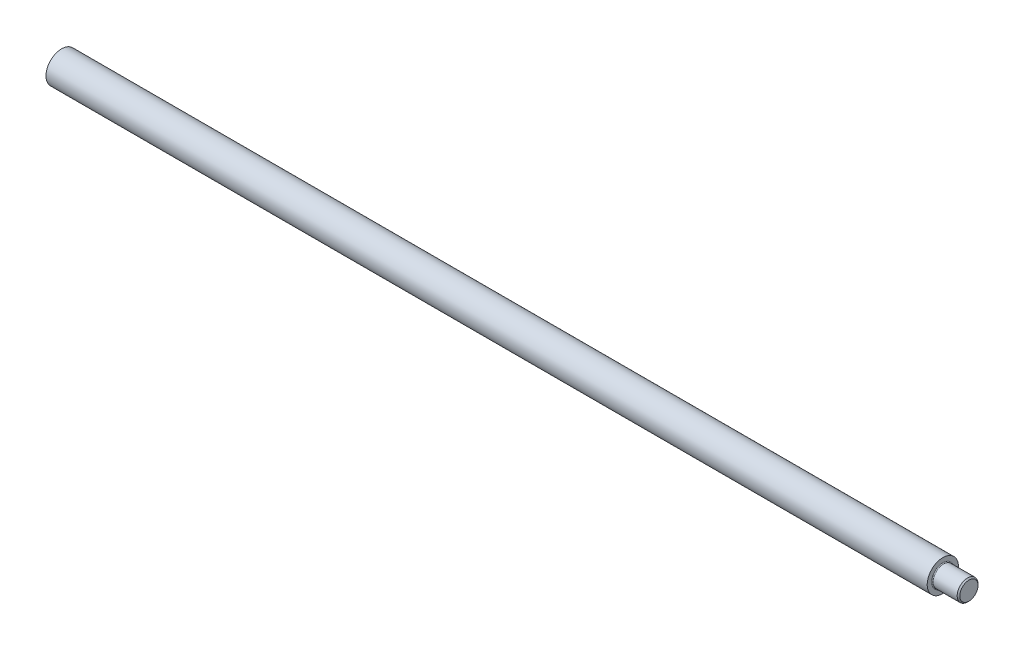
ISO-10303-21;
HEADER;
FILE_DESCRIPTION(('STEP AP214'),'2;1');
FILE_NAME('part.step','',(''),(''),'','','');
FILE_SCHEMA(('AUTOMOTIVE_DESIGN { 1 0 10303 214 1 1 1 1 }'));
ENDSEC;
DATA;
#1=APPLICATION_CONTEXT('core data for automotive mechanical design processes');
#2=APPLICATION_PROTOCOL_DEFINITION('international standard','automotive_design',2000,#1);
#3=PRODUCT_CONTEXT('',#1,'mechanical');
#4=PRODUCT('Part','Part','',(#3));
#5=PRODUCT_RELATED_PRODUCT_CATEGORY('part','',(#4));
#6=PRODUCT_DEFINITION_FORMATION('','',#4);
#7=PRODUCT_DEFINITION_CONTEXT('part definition',#1,'design');
#8=PRODUCT_DEFINITION('design','',#6,#7);
#9=PRODUCT_DEFINITION_SHAPE('','',#8);
#10=(LENGTH_UNIT() NAMED_UNIT(*) SI_UNIT(.MILLI.,.METRE.));
#11=(NAMED_UNIT(*) PLANE_ANGLE_UNIT() SI_UNIT($,.RADIAN.));
#12=(NAMED_UNIT(*) SI_UNIT($,.STERADIAN.) SOLID_ANGLE_UNIT());
#13=UNCERTAINTY_MEASURE_WITH_UNIT(LENGTH_MEASURE(1.E-05),#10,'distance_accuracy_value','');
#14=(GEOMETRIC_REPRESENTATION_CONTEXT(3) GLOBAL_UNCERTAINTY_ASSIGNED_CONTEXT((#13)) GLOBAL_UNIT_ASSIGNED_CONTEXT((#10,
#11,#12)) REPRESENTATION_CONTEXT('',''));
#15=CARTESIAN_POINT('',(0.,0.,0.));
#16=DIRECTION('',(0.,0.,1.));
#17=DIRECTION('',(1.,0.,0.));
#18=AXIS2_PLACEMENT_3D('',#15,#16,#17);
#19=CARTESIAN_POINT('',(30.,0.,0.));
#20=DIRECTION('',(1.,0.,0.));
#21=DIRECTION('',(0.,0.,-1.));
#22=AXIS2_PLACEMENT_3D('',#19,#20,#21);
#23=CYLINDRICAL_SURFACE('',#22,5.68421052631579);
#24=CARTESIAN_POINT('',(30.,0.,0.));
#25=DIRECTION('',(1.,0.,0.));
#26=DIRECTION('',(0.,0.,-1.));
#27=AXIS2_PLACEMENT_3D('',#24,#25,#26);
#28=CIRCLE('',#27,5.68421052631579);
#29=CARTESIAN_POINT('',(30.,0.,-5.68421052631579));
#30=VERTEX_POINT('',#29);
#31=EDGE_CURVE('E55',#30,#30,#28,.T.);
#32=ORIENTED_EDGE('',*,*,#31,.T.);
#33=EDGE_LOOP('',(#32));
#34=FACE_BOUND('',#33,.T.);
#35=CARTESIAN_POINT('',(350.526315789474,0.,0.));
#36=DIRECTION('',(1.,0.,0.));
#37=DIRECTION('',(0.,0.,-1.));
#38=AXIS2_PLACEMENT_3D('',#35,#36,#37);
#39=CIRCLE('',#38,5.68421052631579);
#40=CARTESIAN_POINT('',(350.526315789474,0.,-5.68421052631579));
#41=VERTEX_POINT('',#40);
#42=EDGE_CURVE('E10',#41,#41,#39,.T.);
#43=ORIENTED_EDGE('',*,*,#42,.F.);
#44=EDGE_LOOP('',(#43));
#45=FACE_BOUND('',#44,.T.);
#46=ADVANCED_FACE('F33',(#34,#45),#23,.T.);
#47=CARTESIAN_POINT('',(350.526315789474,4.07368421052639,0.));
#48=DIRECTION('',(1.,0.,0.));
#49=DIRECTION('',(0.,0.,-1.));
#50=AXIS2_PLACEMENT_3D('',#47,#48,#49);
#51=PLANE('',#50);
#52=ORIENTED_EDGE('',*,*,#42,.T.);
#53=EDGE_LOOP('',(#52));
#54=FACE_BOUND('',#53,.T.);
#55=CARTESIAN_POINT('',(350.526315789474,0.,0.));
#56=DIRECTION('',(1.,0.,0.));
#57=DIRECTION('',(0.,0.,-1.));
#58=AXIS2_PLACEMENT_3D('',#55,#56,#57);
#59=CIRCLE('',#58,4.07368421052639);
#60=CARTESIAN_POINT('',(350.526315789474,0.,-4.07368421052639));
#61=VERTEX_POINT('',#60);
#62=EDGE_CURVE('E39',#61,#61,#59,.T.);
#63=ORIENTED_EDGE('',*,*,#62,.F.);
#64=EDGE_LOOP('',(#63));
#65=FACE_BOUND('',#64,.T.);
#66=ADVANCED_FACE('F72',(#54,#65),#51,.T.);
#67=CARTESIAN_POINT('',(350.81052631579,0.,0.));
#68=DIRECTION('',(1.,0.,0.));
#69=DIRECTION('',(0.,0.,-1.));
#70=AXIS2_PLACEMENT_3D('',#67,#68,#69);
#71=TOROIDAL_SURFACE('',#70,4.07368421052639,0.284210526315843);
#72=ORIENTED_EDGE('',*,*,#62,.T.);
#73=EDGE_LOOP('',(#72));
#74=FACE_BOUND('',#73,.T.);
#75=CARTESIAN_POINT('',(350.81052631579,0.,0.));
#76=DIRECTION('',(1.,0.,0.));
#77=DIRECTION('',(0.,0.,-1.));
#78=AXIS2_PLACEMENT_3D('',#75,#76,#77);
#79=CIRCLE('',#78,3.78947368421054);
#80=CARTESIAN_POINT('',(350.81052631579,0.,-3.78947368421054));
#81=VERTEX_POINT('',#80);
#82=EDGE_CURVE('E43',#81,#81,#79,.T.);
#83=ORIENTED_EDGE('',*,*,#82,.F.);
#84=EDGE_LOOP('',(#83));
#85=FACE_BOUND('',#84,.T.);
#86=ADVANCED_FACE('F76',(#74,#85),#71,.F.);
#87=CARTESIAN_POINT('',(30.,0.,0.));
#88=DIRECTION('',(1.,0.,0.));
#89=DIRECTION('',(0.,0.,-1.));
#90=AXIS2_PLACEMENT_3D('',#87,#88,#89);
#91=CYLINDRICAL_SURFACE('',#90,3.78947368421054);
#92=ORIENTED_EDGE('',*,*,#82,.T.);
#93=EDGE_LOOP('',(#92));
#94=FACE_BOUND('',#93,.T.);
#95=CARTESIAN_POINT('',(359.526315789474,0.,0.));
#96=DIRECTION('',(1.,0.,0.));
#97=DIRECTION('',(0.,0.,-1.));
#98=AXIS2_PLACEMENT_3D('',#95,#96,#97);
#99=CIRCLE('',#98,3.78947368421054);
#100=CARTESIAN_POINT('',(359.526315789474,0.,-3.78947368421054));
#101=VERTEX_POINT('',#100);
#102=EDGE_CURVE('E47',#101,#101,#99,.T.);
#103=ORIENTED_EDGE('',*,*,#102,.F.);
#104=EDGE_LOOP('',(#103));
#105=FACE_BOUND('',#104,.T.);
#106=ADVANCED_FACE('F80',(#94,#105),#91,.T.);
#107=CARTESIAN_POINT('',(360.,0.,0.));
#108=DIRECTION('',(-1.,0.,0.));
#109=DIRECTION('',(0.,0.,1.));
#110=AXIS2_PLACEMENT_3D('',#107,#108,#109);
#111=CONICAL_SURFACE('',#110,3.31578947368422,0.785398163397468);
#112=ORIENTED_EDGE('',*,*,#102,.T.);
#113=EDGE_LOOP('',(#112));
#114=FACE_BOUND('',#113,.T.);
#115=CARTESIAN_POINT('',(360.,0.,0.));
#116=DIRECTION('',(1.,0.,0.));
#117=DIRECTION('',(0.,0.,-1.));
#118=AXIS2_PLACEMENT_3D('',#115,#116,#117);
#119=CIRCLE('',#118,3.31578947368422);
#120=CARTESIAN_POINT('',(360.,0.,-3.31578947368422));
#121=VERTEX_POINT('',#120);
#122=EDGE_CURVE('E52',#121,#121,#119,.T.);
#123=ORIENTED_EDGE('',*,*,#122,.F.);
#124=EDGE_LOOP('',(#123));
#125=FACE_BOUND('',#124,.T.);
#126=ADVANCED_FACE('F68',(#114,#125),#111,.T.);
#127=CARTESIAN_POINT('',(360.,0.,0.));
#128=DIRECTION('',(1.,0.,0.));
#129=DIRECTION('',(0.,0.,-1.));
#130=AXIS2_PLACEMENT_3D('',#127,#128,#129);
#131=PLANE('',#130);
#132=ORIENTED_EDGE('',*,*,#122,.T.);
#133=EDGE_LOOP('',(#132));
#134=FACE_BOUND('',#133,.T.);
#135=ADVANCED_FACE('F63',(#134),#131,.T.);
#136=CARTESIAN_POINT('',(30.,5.68421052631579,0.));
#137=DIRECTION('',(-1.,0.,0.));
#138=DIRECTION('',(0.,0.,1.));
#139=AXIS2_PLACEMENT_3D('',#136,#137,#138);
#140=PLANE('',#139);
#141=ORIENTED_EDGE('',*,*,#31,.F.);
#142=EDGE_LOOP('',(#141));
#143=FACE_BOUND('',#142,.T.);
#144=ADVANCED_FACE('F61',(#143),#140,.T.);
#145=CLOSED_SHELL('',(#46,#66,#86,#106,#126,#135,#144));
#146=MANIFOLD_SOLID_BREP('B2',#145);
#147=ADVANCED_BREP_SHAPE_REPRESENTATION('',(#18,#146),#14);
#148=SHAPE_DEFINITION_REPRESENTATION(#9,#147);
ENDSEC;
END-ISO-10303-21;
